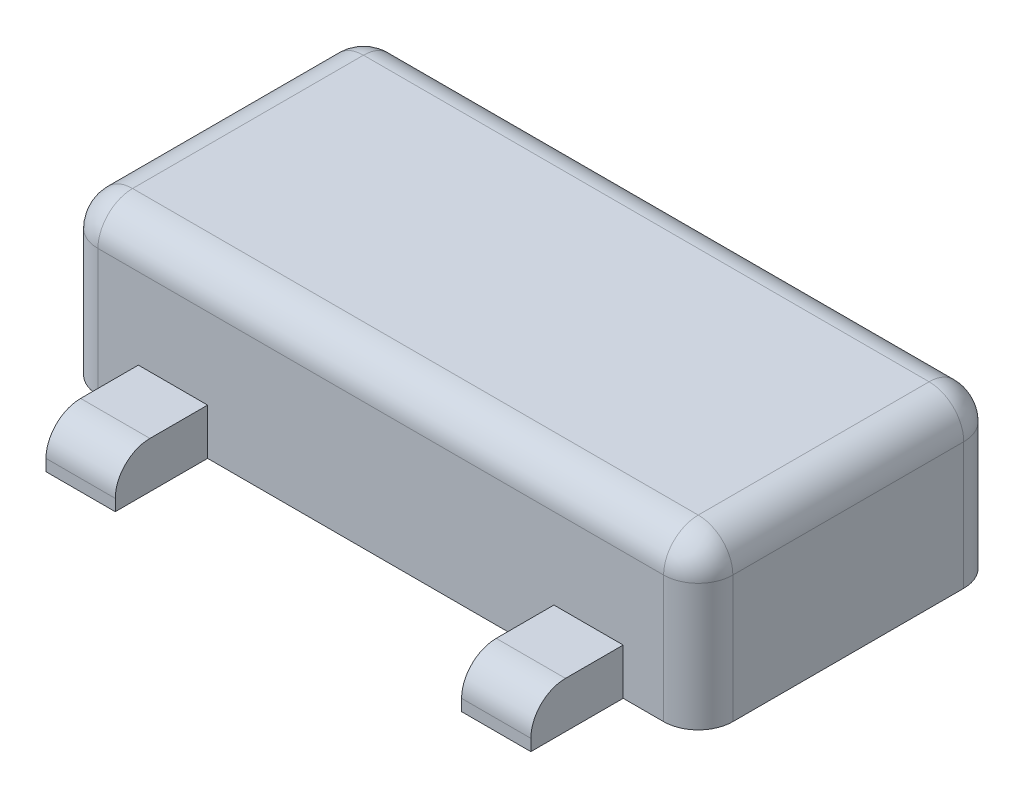
ISO-10303-21;
HEADER;
FILE_DESCRIPTION(('STEP AP214'),'2;1');
FILE_NAME('part.step','',(''),(''),'','','');
FILE_SCHEMA(('AUTOMOTIVE_DESIGN { 1 0 10303 214 1 1 1 1 }'));
ENDSEC;
DATA;
#1=APPLICATION_CONTEXT('core data for automotive mechanical design processes');
#2=APPLICATION_PROTOCOL_DEFINITION('international standard','automotive_design',2000,#1);
#3=PRODUCT_CONTEXT('',#1,'mechanical');
#4=PRODUCT('Part','Part','',(#3));
#5=PRODUCT_RELATED_PRODUCT_CATEGORY('part','',(#4));
#6=PRODUCT_DEFINITION_FORMATION('','',#4);
#7=PRODUCT_DEFINITION_CONTEXT('part definition',#1,'design');
#8=PRODUCT_DEFINITION('design','',#6,#7);
#9=PRODUCT_DEFINITION_SHAPE('','',#8);
#10=(LENGTH_UNIT() NAMED_UNIT(*) SI_UNIT(.MILLI.,.METRE.));
#11=(NAMED_UNIT(*) PLANE_ANGLE_UNIT() SI_UNIT($,.RADIAN.));
#12=(NAMED_UNIT(*) SI_UNIT($,.STERADIAN.) SOLID_ANGLE_UNIT());
#13=UNCERTAINTY_MEASURE_WITH_UNIT(LENGTH_MEASURE(1.E-05),#10,'distance_accuracy_value','');
#14=(GEOMETRIC_REPRESENTATION_CONTEXT(3) GLOBAL_UNCERTAINTY_ASSIGNED_CONTEXT((#13)) GLOBAL_UNIT_ASSIGNED_CONTEXT((#10,
#11,#12)) REPRESENTATION_CONTEXT('',''));
#15=CARTESIAN_POINT('',(0.,0.,0.));
#16=DIRECTION('',(0.,0.,1.));
#17=DIRECTION('',(1.,0.,0.));
#18=AXIS2_PLACEMENT_3D('',#15,#16,#17);
#19=CARTESIAN_POINT('',(-0.15,0.2,-0.65));
#20=DIRECTION('',(-1.,0.,0.));
#21=DIRECTION('',(0.,0.,1.));
#22=AXIS2_PLACEMENT_3D('',#19,#20,#21);
#23=PLANE('',#22);
#24=DIRECTION('',(0.,0.,-1.));
#25=VECTOR('',#24,1.);
#26=CARTESIAN_POINT('',(-0.15,0.2,-0.65));
#27=LINE('',#26,#25);
#28=CARTESIAN_POINT('',(-0.15,0.2,-0.65));
#29=VERTEX_POINT('',#28);
#30=CARTESIAN_POINT('',(-0.15,0.2,-0.9));
#31=VERTEX_POINT('',#30);
#32=EDGE_CURVE('P0_E68',#29,#31,#27,.T.);
#33=ORIENTED_EDGE('',*,*,#32,.T.);
#34=CARTESIAN_POINT('',(-0.15,0.05,-0.9));
#35=DIRECTION('',(-1.,0.,0.));
#36=DIRECTION('',(0.,0.,1.));
#37=AXIS2_PLACEMENT_3D('',#34,#35,#36);
#38=CIRCLE('',#37,0.15);
#39=CARTESIAN_POINT('',(-0.15,0.05,-1.05));
#40=VERTEX_POINT('',#39);
#41=EDGE_CURVE('P0_E11',#31,#40,#38,.T.);
#42=ORIENTED_EDGE('',*,*,#41,.T.);
#43=DIRECTION('',(0.,-1.,0.));
#44=VECTOR('',#43,1.);
#45=CARTESIAN_POINT('',(-0.15,0.2,-1.05));
#46=LINE('',#45,#44);
#47=CARTESIAN_POINT('',(-0.15,0.,-1.05));
#48=VERTEX_POINT('',#47);
#49=EDGE_CURVE('P0_E80',#40,#48,#46,.T.);
#50=ORIENTED_EDGE('',*,*,#49,.T.);
#51=DIRECTION('',(0.,0.,-1.));
#52=VECTOR('',#51,1.);
#53=CARTESIAN_POINT('',(-0.15,0.,-0.65));
#54=LINE('',#53,#52);
#55=CARTESIAN_POINT('',(-0.15,0.,-0.65));
#56=VERTEX_POINT('',#55);
#57=EDGE_CURVE('P0_E85',#56,#48,#54,.T.);
#58=ORIENTED_EDGE('',*,*,#57,.F.);
#59=DIRECTION('',(0.,-1.,0.));
#60=VECTOR('',#59,1.);
#61=CARTESIAN_POINT('',(-0.15,0.2,-0.65));
#62=LINE('',#61,#60);
#63=EDGE_CURVE('P0_E76',#29,#56,#62,.T.);
#64=ORIENTED_EDGE('',*,*,#63,.F.);
#65=EDGE_LOOP('',(#33,#42,#50,#58,#64));
#66=FACE_BOUND('',#65,.T.);
#67=ADVANCED_FACE('P0_F17',(#66),#23,.T.);
#68=CARTESIAN_POINT('',(-0.15,0.2,-0.65));
#69=DIRECTION('',(0.,0.,1.));
#70=DIRECTION('',(1.,0.,0.));
#71=AXIS2_PLACEMENT_3D('',#68,#69,#70);
#72=PLANE('',#71);
#73=DIRECTION('',(-1.,0.,0.));
#74=VECTOR('',#73,1.);
#75=CARTESIAN_POINT('',(-0.15,0.,-0.65));
#76=LINE('',#75,#74);
#77=CARTESIAN_POINT('',(0.15,0.,-0.65));
#78=VERTEX_POINT('',#77);
#79=EDGE_CURVE('P0_E75',#78,#56,#76,.T.);
#80=ORIENTED_EDGE('',*,*,#79,.F.);
#81=DIRECTION('',(0.,-1.,0.));
#82=VECTOR('',#81,1.);
#83=CARTESIAN_POINT('',(0.15,0.2,-0.65));
#84=LINE('',#83,#82);
#85=CARTESIAN_POINT('',(0.15,0.2,-0.65));
#86=VERTEX_POINT('',#85);
#87=EDGE_CURVE('P0_E64',#86,#78,#84,.T.);
#88=ORIENTED_EDGE('',*,*,#87,.F.);
#89=DIRECTION('',(-1.,0.,0.));
#90=VECTOR('',#89,1.);
#91=CARTESIAN_POINT('',(-0.15,0.2,-0.65));
#92=LINE('',#91,#90);
#93=EDGE_CURVE('P0_E67',#86,#29,#92,.T.);
#94=ORIENTED_EDGE('',*,*,#93,.T.);
#95=ORIENTED_EDGE('',*,*,#63,.T.);
#96=EDGE_LOOP('',(#80,#88,#94,#95));
#97=FACE_BOUND('',#96,.T.);
#98=ADVANCED_FACE('P0_F73',(#97),#72,.T.);
#99=CARTESIAN_POINT('',(0.15,0.2,-0.65));
#100=DIRECTION('',(1.,0.,0.));
#101=DIRECTION('',(0.,0.,-1.));
#102=AXIS2_PLACEMENT_3D('',#99,#100,#101);
#103=PLANE('',#102);
#104=DIRECTION('',(0.,-1.,0.));
#105=VECTOR('',#104,1.);
#106=CARTESIAN_POINT('',(0.15,0.2,-1.05));
#107=LINE('',#106,#105);
#108=CARTESIAN_POINT('',(0.15,0.05,-1.05));
#109=VERTEX_POINT('',#108);
#110=CARTESIAN_POINT('',(0.15,0.,-1.05));
#111=VERTEX_POINT('',#110);
#112=EDGE_CURVE('P0_E77',#109,#111,#107,.T.);
#113=ORIENTED_EDGE('',*,*,#112,.F.);
#114=CARTESIAN_POINT('',(0.15,0.05,-0.9));
#115=DIRECTION('',(1.,0.,0.));
#116=DIRECTION('',(0.,0.,-1.));
#117=AXIS2_PLACEMENT_3D('',#114,#115,#116);
#118=CIRCLE('',#117,0.15);
#119=CARTESIAN_POINT('',(0.15,0.2,-0.9));
#120=VERTEX_POINT('',#119);
#121=EDGE_CURVE('P0_E39',#109,#120,#118,.T.);
#122=ORIENTED_EDGE('',*,*,#121,.T.);
#123=DIRECTION('',(0.,0.,1.));
#124=VECTOR('',#123,1.);
#125=CARTESIAN_POINT('',(0.15,0.2,-0.65));
#126=LINE('',#125,#124);
#127=EDGE_CURVE('P0_E60',#120,#86,#126,.T.);
#128=ORIENTED_EDGE('',*,*,#127,.T.);
#129=ORIENTED_EDGE('',*,*,#87,.T.);
#130=DIRECTION('',(0.,0.,1.));
#131=VECTOR('',#130,1.);
#132=CARTESIAN_POINT('',(0.15,0.,-0.65));
#133=LINE('',#132,#131);
#134=EDGE_CURVE('P0_E91',#111,#78,#133,.T.);
#135=ORIENTED_EDGE('',*,*,#134,.F.);
#136=EDGE_LOOP('',(#113,#122,#128,#129,#135));
#137=FACE_BOUND('',#136,.T.);
#138=ADVANCED_FACE('P0_F62',(#137),#103,.T.);
#139=CARTESIAN_POINT('',(-0.15,0.2,-1.05));
#140=DIRECTION('',(0.,0.,-1.));
#141=DIRECTION('',(-1.,0.,0.));
#142=AXIS2_PLACEMENT_3D('',#139,#140,#141);
#143=PLANE('',#142);
#144=ORIENTED_EDGE('',*,*,#49,.F.);
#145=DIRECTION('',(1.,0.,0.));
#146=VECTOR('',#145,1.);
#147=CARTESIAN_POINT('',(0.15,0.05,-1.05));
#148=LINE('',#147,#146);
#149=EDGE_CURVE('P0_E94',#40,#109,#148,.T.);
#150=ORIENTED_EDGE('',*,*,#149,.T.);
#151=ORIENTED_EDGE('',*,*,#112,.T.);
#152=DIRECTION('',(1.,0.,0.));
#153=VECTOR('',#152,1.);
#154=CARTESIAN_POINT('',(-0.15,0.,-1.05));
#155=LINE('',#154,#153);
#156=EDGE_CURVE('P0_E88',#48,#111,#155,.T.);
#157=ORIENTED_EDGE('',*,*,#156,.F.);
#158=EDGE_LOOP('',(#144,#150,#151,#157));
#159=FACE_BOUND('',#158,.T.);
#160=ADVANCED_FACE('P0_F102',(#159),#143,.T.);
#161=CARTESIAN_POINT('',(0.,0.2,0.));
#162=DIRECTION('',(0.,-1.,0.));
#163=DIRECTION('',(0.,0.,-1.));
#164=AXIS2_PLACEMENT_3D('',#161,#162,#163);
#165=PLANE('',#164);
#166=ORIENTED_EDGE('',*,*,#127,.F.);
#167=DIRECTION('',(1.,0.,0.));
#168=VECTOR('',#167,1.);
#169=CARTESIAN_POINT('',(-0.15,0.2,-0.9));
#170=LINE('',#169,#168);
#171=EDGE_CURVE('P0_E25',#120,#31,#170,.F.);
#172=ORIENTED_EDGE('',*,*,#171,.T.);
#173=ORIENTED_EDGE('',*,*,#32,.F.);
#174=ORIENTED_EDGE('',*,*,#93,.F.);
#175=EDGE_LOOP('',(#166,#172,#173,#174));
#176=FACE_BOUND('',#175,.T.);
#177=ADVANCED_FACE('P0_F79',(#176),#165,.F.);
#178=CARTESIAN_POINT('',(0.,0.,0.));
#179=DIRECTION('',(0.,-1.,0.));
#180=DIRECTION('',(0.,0.,-1.));
#181=AXIS2_PLACEMENT_3D('',#178,#179,#180);
#182=PLANE('',#181);
#183=ORIENTED_EDGE('',*,*,#57,.T.);
#184=ORIENTED_EDGE('',*,*,#156,.T.);
#185=ORIENTED_EDGE('',*,*,#134,.T.);
#186=ORIENTED_EDGE('',*,*,#79,.T.);
#187=EDGE_LOOP('',(#183,#184,#185,#186));
#188=FACE_BOUND('',#187,.T.);
#189=ADVANCED_FACE('P0_F107',(#188),#182,.T.);
#190=CARTESIAN_POINT('',(-0.15,0.05,-0.9));
#191=DIRECTION('',(-1.,0.,0.));
#192=DIRECTION('',(0.,0.,1.));
#193=AXIS2_PLACEMENT_3D('',#190,#191,#192);
#194=CYLINDRICAL_SURFACE('',#193,0.15);
#195=ORIENTED_EDGE('',*,*,#41,.F.);
#196=ORIENTED_EDGE('',*,*,#171,.F.);
#197=ORIENTED_EDGE('',*,*,#121,.F.);
#198=ORIENTED_EDGE('',*,*,#149,.F.);
#199=EDGE_LOOP('',(#195,#196,#197,#198));
#200=FACE_BOUND('',#199,.T.);
#201=ADVANCED_FACE('P0_F19',(#200),#194,.T.);
#202=CLOSED_SHELL('',(#67,#98,#138,#160,#177,#189,#201));
#203=MANIFOLD_SOLID_BREP('P0_B1',#202);
#204=CARTESIAN_POINT('',(-1.05,0.2,0.65));
#205=DIRECTION('',(-1.,0.,0.));
#206=DIRECTION('',(0.,0.,1.));
#207=AXIS2_PLACEMENT_3D('',#204,#205,#206);
#208=PLANE('',#207);
#209=DIRECTION('',(0.,-1.,0.));
#210=VECTOR('',#209,1.);
#211=CARTESIAN_POINT('',(-1.05,0.2,1.05));
#212=LINE('',#211,#210);
#213=CARTESIAN_POINT('',(-1.05,0.05,1.05));
#214=VERTEX_POINT('',#213);
#215=CARTESIAN_POINT('',(-1.05,0.,1.05));
#216=VERTEX_POINT('',#215);
#217=EDGE_CURVE('P1_E90',#214,#216,#212,.T.);
#218=ORIENTED_EDGE('',*,*,#217,.F.);
#219=CARTESIAN_POINT('',(-1.05,0.05,0.9));
#220=DIRECTION('',(-1.,0.,0.));
#221=DIRECTION('',(0.,0.,1.));
#222=AXIS2_PLACEMENT_3D('',#219,#220,#221);
#223=CIRCLE('',#222,0.15);
#224=CARTESIAN_POINT('',(-1.05,0.2,0.9));
#225=VERTEX_POINT('',#224);
#226=EDGE_CURVE('P1_E39',#214,#225,#223,.T.);
#227=ORIENTED_EDGE('',*,*,#226,.T.);
#228=DIRECTION('',(0.,0.,-1.));
#229=VECTOR('',#228,1.);
#230=CARTESIAN_POINT('',(-1.05,0.2,0.65));
#231=LINE('',#230,#229);
#232=CARTESIAN_POINT('',(-1.05,0.2,0.65));
#233=VERTEX_POINT('',#232);
#234=EDGE_CURVE('P1_E60',#225,#233,#231,.T.);
#235=ORIENTED_EDGE('',*,*,#234,.T.);
#236=DIRECTION('',(0.,-1.,0.));
#237=VECTOR('',#236,1.);
#238=CARTESIAN_POINT('',(-1.05,0.2,0.65));
#239=LINE('',#238,#237);
#240=CARTESIAN_POINT('',(-1.05,0.,0.65));
#241=VERTEX_POINT('',#240);
#242=EDGE_CURVE('P1_E63',#233,#241,#239,.T.);
#243=ORIENTED_EDGE('',*,*,#242,.T.);
#244=DIRECTION('',(0.,0.,-1.));
#245=VECTOR('',#244,1.);
#246=CARTESIAN_POINT('',(-1.05,0.,0.65));
#247=LINE('',#246,#245);
#248=EDGE_CURVE('P1_E82',#216,#241,#247,.T.);
#249=ORIENTED_EDGE('',*,*,#248,.F.);
#250=EDGE_LOOP('',(#218,#227,#235,#243,#249));
#251=FACE_BOUND('',#250,.T.);
#252=ADVANCED_FACE('P1_F17',(#251),#208,.T.);
#253=CARTESIAN_POINT('',(-1.05,0.2,1.05));
#254=DIRECTION('',(0.,0.,1.));
#255=DIRECTION('',(1.,0.,0.));
#256=AXIS2_PLACEMENT_3D('',#253,#254,#255);
#257=PLANE('',#256);
#258=DIRECTION('',(0.,-1.,0.));
#259=VECTOR('',#258,1.);
#260=CARTESIAN_POINT('',(-0.75,0.2,1.05));
#261=LINE('',#260,#259);
#262=CARTESIAN_POINT('',(-0.75,0.05,1.05));
#263=VERTEX_POINT('',#262);
#264=CARTESIAN_POINT('',(-0.75,0.,1.05));
#265=VERTEX_POINT('',#264);
#266=EDGE_CURVE('P1_E93',#263,#265,#261,.T.);
#267=ORIENTED_EDGE('',*,*,#266,.F.);
#268=DIRECTION('',(-1.,0.,0.));
#269=VECTOR('',#268,1.);
#270=CARTESIAN_POINT('',(-1.05,0.05,1.05));
#271=LINE('',#270,#269);
#272=EDGE_CURVE('P1_E92',#263,#214,#271,.T.);
#273=ORIENTED_EDGE('',*,*,#272,.T.);
#274=ORIENTED_EDGE('',*,*,#217,.T.);
#275=DIRECTION('',(-1.,0.,0.));
#276=VECTOR('',#275,1.);
#277=CARTESIAN_POINT('',(-1.05,0.,1.05));
#278=LINE('',#277,#276);
#279=EDGE_CURVE('P1_E67',#265,#216,#278,.T.);
#280=ORIENTED_EDGE('',*,*,#279,.F.);
#281=EDGE_LOOP('',(#267,#273,#274,#280));
#282=FACE_BOUND('',#281,.T.);
#283=ADVANCED_FACE('P1_F101',(#282),#257,.T.);
#284=CARTESIAN_POINT('',(-0.75,0.2,0.65));
#285=DIRECTION('',(1.,0.,0.));
#286=DIRECTION('',(0.,0.,-1.));
#287=AXIS2_PLACEMENT_3D('',#284,#285,#286);
#288=PLANE('',#287);
#289=DIRECTION('',(0.,0.,1.));
#290=VECTOR('',#289,1.);
#291=CARTESIAN_POINT('',(-0.75,0.2,0.65));
#292=LINE('',#291,#290);
#293=CARTESIAN_POINT('',(-0.75,0.2,0.65));
#294=VERTEX_POINT('',#293);
#295=CARTESIAN_POINT('',(-0.75,0.2,0.9));
#296=VERTEX_POINT('',#295);
#297=EDGE_CURVE('P1_E76',#294,#296,#292,.T.);
#298=ORIENTED_EDGE('',*,*,#297,.T.);
#299=CARTESIAN_POINT('',(-0.75,0.05,0.9));
#300=DIRECTION('',(1.,0.,0.));
#301=DIRECTION('',(0.,0.,-1.));
#302=AXIS2_PLACEMENT_3D('',#299,#300,#301);
#303=CIRCLE('',#302,0.15);
#304=EDGE_CURVE('P1_E11',#296,#263,#303,.T.);
#305=ORIENTED_EDGE('',*,*,#304,.T.);
#306=ORIENTED_EDGE('',*,*,#266,.T.);
#307=DIRECTION('',(0.,0.,1.));
#308=VECTOR('',#307,1.);
#309=CARTESIAN_POINT('',(-0.75,0.,0.65));
#310=LINE('',#309,#308);
#311=CARTESIAN_POINT('',(-0.75,0.,0.65));
#312=VERTEX_POINT('',#311);
#313=EDGE_CURVE('P1_E85',#312,#265,#310,.T.);
#314=ORIENTED_EDGE('',*,*,#313,.F.);
#315=DIRECTION('',(0.,-1.,0.));
#316=VECTOR('',#315,1.);
#317=CARTESIAN_POINT('',(-0.75,0.2,0.65));
#318=LINE('',#317,#316);
#319=EDGE_CURVE('P1_E75',#294,#312,#318,.T.);
#320=ORIENTED_EDGE('',*,*,#319,.F.);
#321=EDGE_LOOP('',(#298,#305,#306,#314,#320));
#322=FACE_BOUND('',#321,.T.);
#323=ADVANCED_FACE('P1_F109',(#322),#288,.T.);
#324=CARTESIAN_POINT('',(-1.05,0.2,0.65));
#325=DIRECTION('',(0.,0.,-1.));
#326=DIRECTION('',(-1.,0.,0.));
#327=AXIS2_PLACEMENT_3D('',#324,#325,#326);
#328=PLANE('',#327);
#329=DIRECTION('',(1.,0.,0.));
#330=VECTOR('',#329,1.);
#331=CARTESIAN_POINT('',(-1.05,0.,0.65));
#332=LINE('',#331,#330);
#333=EDGE_CURVE('P1_E73',#241,#312,#332,.T.);
#334=ORIENTED_EDGE('',*,*,#333,.F.);
#335=ORIENTED_EDGE('',*,*,#242,.F.);
#336=DIRECTION('',(1.,0.,0.));
#337=VECTOR('',#336,1.);
#338=CARTESIAN_POINT('',(-1.05,0.2,0.65));
#339=LINE('',#338,#337);
#340=EDGE_CURVE('P1_E66',#233,#294,#339,.T.);
#341=ORIENTED_EDGE('',*,*,#340,.T.);
#342=ORIENTED_EDGE('',*,*,#319,.T.);
#343=EDGE_LOOP('',(#334,#335,#341,#342));
#344=FACE_BOUND('',#343,.T.);
#345=ADVANCED_FACE('P1_F71',(#344),#328,.T.);
#346=CARTESIAN_POINT('',(0.,0.2,0.));
#347=DIRECTION('',(0.,1.,0.));
#348=DIRECTION('',(0.,0.,1.));
#349=AXIS2_PLACEMENT_3D('',#346,#347,#348);
#350=PLANE('',#349);
#351=ORIENTED_EDGE('',*,*,#234,.F.);
#352=DIRECTION('',(-1.,0.,0.));
#353=VECTOR('',#352,1.);
#354=CARTESIAN_POINT('',(0.,0.2,0.9));
#355=LINE('',#354,#353);
#356=EDGE_CURVE('P1_E25',#225,#296,#355,.F.);
#357=ORIENTED_EDGE('',*,*,#356,.T.);
#358=ORIENTED_EDGE('',*,*,#297,.F.);
#359=ORIENTED_EDGE('',*,*,#340,.F.);
#360=EDGE_LOOP('',(#351,#357,#358,#359));
#361=FACE_BOUND('',#360,.T.);
#362=ADVANCED_FACE('P1_F78',(#361),#350,.T.);
#363=CARTESIAN_POINT('',(0.,0.,0.));
#364=DIRECTION('',(0.,1.,0.));
#365=DIRECTION('',(0.,0.,1.));
#366=AXIS2_PLACEMENT_3D('',#363,#364,#365);
#367=PLANE('',#366);
#368=ORIENTED_EDGE('',*,*,#248,.T.);
#369=ORIENTED_EDGE('',*,*,#333,.T.);
#370=ORIENTED_EDGE('',*,*,#313,.T.);
#371=ORIENTED_EDGE('',*,*,#279,.T.);
#372=EDGE_LOOP('',(#368,#369,#370,#371));
#373=FACE_BOUND('',#372,.T.);
#374=ADVANCED_FACE('P1_F106',(#373),#367,.F.);
#375=CARTESIAN_POINT('',(-1.05,0.05,0.9));
#376=DIRECTION('',(-1.,0.,0.));
#377=DIRECTION('',(0.,0.,1.));
#378=AXIS2_PLACEMENT_3D('',#375,#376,#377);
#379=CYLINDRICAL_SURFACE('',#378,0.15);
#380=ORIENTED_EDGE('',*,*,#304,.F.);
#381=ORIENTED_EDGE('',*,*,#356,.F.);
#382=ORIENTED_EDGE('',*,*,#226,.F.);
#383=ORIENTED_EDGE('',*,*,#272,.F.);
#384=EDGE_LOOP('',(#380,#381,#382,#383));
#385=FACE_BOUND('',#384,.T.);
#386=ADVANCED_FACE('P1_F19',(#385),#379,.T.);
#387=CLOSED_SHELL('',(#252,#283,#323,#345,#362,#374,#386));
#388=MANIFOLD_SOLID_BREP('P1_B1',#387);
#389=CARTESIAN_POINT('',(1.375,0.7,0.65));
#390=DIRECTION('',(-1.,0.,0.));
#391=DIRECTION('',(0.,0.,1.));
#392=AXIS2_PLACEMENT_3D('',#389,#390,#391);
#393=PLANE('',#392);
#394=DIRECTION('',(0.,0.,-1.));
#395=VECTOR('',#394,1.);
#396=CARTESIAN_POINT('',(1.375,0.,0.65));
#397=LINE('',#396,#395);
#398=CARTESIAN_POINT('',(1.375,0.,0.5));
#399=VERTEX_POINT('',#398);
#400=CARTESIAN_POINT('',(1.375,0.,-0.5));
#401=VERTEX_POINT('',#400);
#402=EDGE_CURVE('P2_E182',#399,#401,#397,.T.);
#403=ORIENTED_EDGE('',*,*,#402,.T.);
#404=DIRECTION('',(0.,-1.,0.));
#405=VECTOR('',#404,1.);
#406=CARTESIAN_POINT('',(1.375,0.7,-0.5));
#407=LINE('',#406,#405);
#408=CARTESIAN_POINT('',(1.375,0.55,-0.5));
#409=VERTEX_POINT('',#408);
#410=EDGE_CURVE('P2_E34',#401,#409,#407,.F.);
#411=ORIENTED_EDGE('',*,*,#410,.T.);
#412=DIRECTION('',(0.,0.,-1.));
#413=VECTOR('',#412,1.);
#414=CARTESIAN_POINT('',(1.375,0.55,0.65));
#415=LINE('',#414,#413);
#416=CARTESIAN_POINT('',(1.375,0.55,0.5));
#417=VERTEX_POINT('',#416);
#418=EDGE_CURVE('P2_E39',#409,#417,#415,.F.);
#419=ORIENTED_EDGE('',*,*,#418,.T.);
#420=DIRECTION('',(0.,-1.,0.));
#421=VECTOR('',#420,1.);
#422=CARTESIAN_POINT('',(1.375,0.7,0.5));
#423=LINE('',#422,#421);
#424=EDGE_CURVE('P2_E151',#417,#399,#423,.T.);
#425=ORIENTED_EDGE('',*,*,#424,.T.);
#426=EDGE_LOOP('',(#403,#411,#419,#425));
#427=FACE_BOUND('',#426,.T.);
#428=ADVANCED_FACE('P2_F17',(#427),#393,.F.);
#429=CARTESIAN_POINT('',(-1.375,0.7,-0.65));
#430=DIRECTION('',(0.,0.,1.));
#431=DIRECTION('',(1.,0.,0.));
#432=AXIS2_PLACEMENT_3D('',#429,#430,#431);
#433=PLANE('',#432);
#434=DIRECTION('',(-1.,0.,0.));
#435=VECTOR('',#434,1.);
#436=CARTESIAN_POINT('',(-1.375,0.55,-0.65));
#437=LINE('',#436,#435);
#438=CARTESIAN_POINT('',(-1.225,0.55,-0.65));
#439=VERTEX_POINT('',#438);
#440=CARTESIAN_POINT('',(1.225,0.55,-0.65));
#441=VERTEX_POINT('',#440);
#442=EDGE_CURVE('P2_E147',#439,#441,#437,.F.);
#443=ORIENTED_EDGE('',*,*,#442,.T.);
#444=DIRECTION('',(0.,-1.,0.));
#445=VECTOR('',#444,1.);
#446=CARTESIAN_POINT('',(1.225,0.7,-0.65));
#447=LINE('',#446,#445);
#448=CARTESIAN_POINT('',(1.225,0.,-0.65));
#449=VERTEX_POINT('',#448);
#450=EDGE_CURVE('P2_E149',#441,#449,#447,.T.);
#451=ORIENTED_EDGE('',*,*,#450,.T.);
#452=DIRECTION('',(-1.,0.,0.));
#453=VECTOR('',#452,1.);
#454=CARTESIAN_POINT('',(-1.375,0.,-0.65));
#455=LINE('',#454,#453);
#456=CARTESIAN_POINT('',(-1.225,0.,-0.65));
#457=VERTEX_POINT('',#456);
#458=EDGE_CURVE('P2_E184',#449,#457,#455,.T.);
#459=ORIENTED_EDGE('',*,*,#458,.T.);
#460=DIRECTION('',(0.,-1.,0.));
#461=VECTOR('',#460,1.);
#462=CARTESIAN_POINT('',(-1.225,0.7,-0.65));
#463=LINE('',#462,#461);
#464=EDGE_CURVE('P2_E145',#457,#439,#463,.F.);
#465=ORIENTED_EDGE('',*,*,#464,.T.);
#466=EDGE_LOOP('',(#443,#451,#459,#465));
#467=FACE_BOUND('',#466,.T.);
#468=ADVANCED_FACE('P2_F237',(#467),#433,.F.);
#469=CARTESIAN_POINT('',(-1.375,0.7,0.65));
#470=DIRECTION('',(1.,0.,0.));
#471=DIRECTION('',(0.,0.,-1.));
#472=AXIS2_PLACEMENT_3D('',#469,#470,#471);
#473=PLANE('',#472);
#474=DIRECTION('',(0.,0.,1.));
#475=VECTOR('',#474,1.);
#476=CARTESIAN_POINT('',(-1.375,0.55,0.65));
#477=LINE('',#476,#475);
#478=CARTESIAN_POINT('',(-1.375,0.55,0.5));
#479=VERTEX_POINT('',#478);
#480=CARTESIAN_POINT('',(-1.375,0.55,-0.5));
#481=VERTEX_POINT('',#480);
#482=EDGE_CURVE('P2_E141',#479,#481,#477,.F.);
#483=ORIENTED_EDGE('',*,*,#482,.T.);
#484=DIRECTION('',(0.,-1.,0.));
#485=VECTOR('',#484,1.);
#486=CARTESIAN_POINT('',(-1.375,0.7,-0.5));
#487=LINE('',#486,#485);
#488=CARTESIAN_POINT('',(-1.375,0.,-0.5));
#489=VERTEX_POINT('',#488);
#490=EDGE_CURVE('P2_E143',#481,#489,#487,.T.);
#491=ORIENTED_EDGE('',*,*,#490,.T.);
#492=DIRECTION('',(0.,0.,1.));
#493=VECTOR('',#492,1.);
#494=CARTESIAN_POINT('',(-1.375,0.,0.65));
#495=LINE('',#494,#493);
#496=CARTESIAN_POINT('',(-1.375,0.,0.5));
#497=VERTEX_POINT('',#496);
#498=EDGE_CURVE('P2_E188',#489,#497,#495,.T.);
#499=ORIENTED_EDGE('',*,*,#498,.T.);
#500=DIRECTION('',(0.,-1.,0.));
#501=VECTOR('',#500,1.);
#502=CARTESIAN_POINT('',(-1.375,0.7,0.5));
#503=LINE('',#502,#501);
#504=EDGE_CURVE('P2_E139',#497,#479,#503,.F.);
#505=ORIENTED_EDGE('',*,*,#504,.T.);
#506=EDGE_LOOP('',(#483,#491,#499,#505));
#507=FACE_BOUND('',#506,.T.);
#508=ADVANCED_FACE('P2_F242',(#507),#473,.F.);
#509=CARTESIAN_POINT('',(-1.375,0.7,0.65));
#510=DIRECTION('',(0.,0.,-1.));
#511=DIRECTION('',(-1.,0.,0.));
#512=AXIS2_PLACEMENT_3D('',#509,#510,#511);
#513=PLANE('',#512);
#514=DIRECTION('',(1.,0.,0.));
#515=VECTOR('',#514,1.);
#516=CARTESIAN_POINT('',(-1.375,0.,0.65));
#517=LINE('',#516,#515);
#518=CARTESIAN_POINT('',(-1.225,0.,0.65));
#519=VERTEX_POINT('',#518);
#520=CARTESIAN_POINT('',(1.225,0.,0.65));
#521=VERTEX_POINT('',#520);
#522=EDGE_CURVE('P2_E124',#519,#521,#517,.T.);
#523=ORIENTED_EDGE('',*,*,#522,.T.);
#524=DIRECTION('',(0.,-1.,0.));
#525=VECTOR('',#524,1.);
#526=CARTESIAN_POINT('',(1.225,0.7,0.65));
#527=LINE('',#526,#525);
#528=CARTESIAN_POINT('',(1.225,0.55,0.65));
#529=VERTEX_POINT('',#528);
#530=EDGE_CURVE('P2_E137',#521,#529,#527,.F.);
#531=ORIENTED_EDGE('',*,*,#530,.T.);
#532=DIRECTION('',(1.,0.,0.));
#533=VECTOR('',#532,1.);
#534=CARTESIAN_POINT('',(-1.375,0.55,0.65));
#535=LINE('',#534,#533);
#536=CARTESIAN_POINT('',(-1.225,0.55,0.65));
#537=VERTEX_POINT('',#536);
#538=EDGE_CURVE('P2_E102',#529,#537,#535,.F.);
#539=ORIENTED_EDGE('',*,*,#538,.T.);
#540=DIRECTION('',(0.,-1.,0.));
#541=VECTOR('',#540,1.);
#542=CARTESIAN_POINT('',(-1.225,0.7,0.65));
#543=LINE('',#542,#541);
#544=EDGE_CURVE('P2_E130',#537,#519,#543,.T.);
#545=ORIENTED_EDGE('',*,*,#544,.T.);
#546=EDGE_LOOP('',(#523,#531,#539,#545));
#547=FACE_BOUND('',#546,.T.);
#548=ADVANCED_FACE('P2_F213',(#547),#513,.F.);
#549=CARTESIAN_POINT('',(0.,0.7,0.));
#550=DIRECTION('',(0.,-1.,0.));
#551=DIRECTION('',(0.,0.,-1.));
#552=AXIS2_PLACEMENT_3D('',#549,#550,#551);
#553=PLANE('',#552);
#554=DIRECTION('',(0.,0.,1.));
#555=VECTOR('',#554,1.);
#556=CARTESIAN_POINT('',(-1.225,0.7,0.));
#557=LINE('',#556,#555);
#558=CARTESIAN_POINT('',(-1.225,0.7,-0.5));
#559=VERTEX_POINT('',#558);
#560=CARTESIAN_POINT('',(-1.225,0.7,0.5));
#561=VERTEX_POINT('',#560);
#562=EDGE_CURVE('P2_E128',#559,#561,#557,.T.);
#563=ORIENTED_EDGE('',*,*,#562,.T.);
#564=DIRECTION('',(1.,0.,0.));
#565=VECTOR('',#564,1.);
#566=CARTESIAN_POINT('',(0.,0.7,0.5));
#567=LINE('',#566,#565);
#568=CARTESIAN_POINT('',(1.225,0.7,0.5));
#569=VERTEX_POINT('',#568);
#570=EDGE_CURVE('P2_E100',#561,#569,#567,.T.);
#571=ORIENTED_EDGE('',*,*,#570,.T.);
#572=DIRECTION('',(0.,0.,-1.));
#573=VECTOR('',#572,1.);
#574=CARTESIAN_POINT('',(1.225,0.7,0.));
#575=LINE('',#574,#573);
#576=CARTESIAN_POINT('',(1.225,0.7,-0.5));
#577=VERTEX_POINT('',#576);
#578=EDGE_CURVE('P2_E117',#569,#577,#575,.T.);
#579=ORIENTED_EDGE('',*,*,#578,.T.);
#580=DIRECTION('',(-1.,0.,0.));
#581=VECTOR('',#580,1.);
#582=CARTESIAN_POINT('',(0.,0.7,-0.5));
#583=LINE('',#582,#581);
#584=EDGE_CURVE('P2_E123',#577,#559,#583,.T.);
#585=ORIENTED_EDGE('',*,*,#584,.T.);
#586=EDGE_LOOP('',(#563,#571,#579,#585));
#587=FACE_BOUND('',#586,.T.);
#588=ADVANCED_FACE('P2_F126',(#587),#553,.F.);
#589=CARTESIAN_POINT('',(0.,0.,0.));
#590=DIRECTION('',(0.,-1.,0.));
#591=DIRECTION('',(0.,0.,-1.));
#592=AXIS2_PLACEMENT_3D('',#589,#590,#591);
#593=PLANE('',#592);
#594=ORIENTED_EDGE('',*,*,#458,.F.);
#595=CARTESIAN_POINT('',(1.225,0.,-0.5));
#596=DIRECTION('',(0.,-1.,0.));
#597=DIRECTION('',(0.,0.,-1.));
#598=AXIS2_PLACEMENT_3D('',#595,#596,#597);
#599=CIRCLE('',#598,0.15);
#600=EDGE_CURVE('P2_E11',#449,#401,#599,.T.);
#601=ORIENTED_EDGE('',*,*,#600,.T.);
#602=ORIENTED_EDGE('',*,*,#402,.F.);
#603=CARTESIAN_POINT('',(1.225,0.,0.5));
#604=DIRECTION('',(0.,-1.,0.));
#605=DIRECTION('',(0.,0.,-1.));
#606=AXIS2_PLACEMENT_3D('',#603,#604,#605);
#607=CIRCLE('',#606,0.15);
#608=EDGE_CURVE('P2_E26',#399,#521,#607,.T.);
#609=ORIENTED_EDGE('',*,*,#608,.T.);
#610=ORIENTED_EDGE('',*,*,#522,.F.);
#611=CARTESIAN_POINT('',(-1.225,0.,0.5));
#612=DIRECTION('',(0.,-1.,0.));
#613=DIRECTION('',(0.,0.,-1.));
#614=AXIS2_PLACEMENT_3D('',#611,#612,#613);
#615=CIRCLE('',#614,0.15);
#616=EDGE_CURVE('P2_E155',#519,#497,#615,.T.);
#617=ORIENTED_EDGE('',*,*,#616,.T.);
#618=ORIENTED_EDGE('',*,*,#498,.F.);
#619=CARTESIAN_POINT('',(-1.225,0.,-0.5));
#620=DIRECTION('',(0.,-1.,0.));
#621=DIRECTION('',(0.,0.,-1.));
#622=AXIS2_PLACEMENT_3D('',#619,#620,#621);
#623=CIRCLE('',#622,0.15);
#624=EDGE_CURVE('P2_E157',#489,#457,#623,.T.);
#625=ORIENTED_EDGE('',*,*,#624,.T.);
#626=EDGE_LOOP('',(#594,#601,#602,#609,#610,#617,#618,#625));
#627=FACE_BOUND('',#626,.T.);
#628=ADVANCED_FACE('P2_F220',(#627),#593,.T.);
#629=CARTESIAN_POINT('',(-1.225,0.7,-0.5));
#630=DIRECTION('',(0.,-1.,0.));
#631=DIRECTION('',(0.,0.,-1.));
#632=AXIS2_PLACEMENT_3D('',#629,#630,#631);
#633=CYLINDRICAL_SURFACE('',#632,0.15);
#634=ORIENTED_EDGE('',*,*,#624,.F.);
#635=ORIENTED_EDGE('',*,*,#490,.F.);
#636=CARTESIAN_POINT('',(-1.225,0.55,-0.5));
#637=DIRECTION('',(0.,1.,0.));
#638=DIRECTION('',(0.,0.,1.));
#639=AXIS2_PLACEMENT_3D('',#636,#637,#638);
#640=CIRCLE('',#639,0.15);
#641=EDGE_CURVE('P2_E21',#439,#481,#640,.T.);
#642=ORIENTED_EDGE('',*,*,#641,.F.);
#643=ORIENTED_EDGE('',*,*,#464,.F.);
#644=EDGE_LOOP('',(#634,#635,#642,#643));
#645=FACE_BOUND('',#644,.T.);
#646=ADVANCED_FACE('P2_F19',(#645),#633,.T.);
#647=CARTESIAN_POINT('',(0.,0.55,-0.5));
#648=DIRECTION('',(-1.,0.,0.));
#649=DIRECTION('',(0.,0.,1.));
#650=AXIS2_PLACEMENT_3D('',#647,#648,#649);
#651=CYLINDRICAL_SURFACE('',#650,0.15);
#652=CARTESIAN_POINT('',(1.225,0.55,-0.5));
#653=DIRECTION('',(1.,0.,0.));
#654=DIRECTION('',(0.,0.,-1.));
#655=AXIS2_PLACEMENT_3D('',#652,#653,#654);
#656=CIRCLE('',#655,0.15);
#657=EDGE_CURVE('P2_E174',#441,#577,#656,.T.);
#658=ORIENTED_EDGE('',*,*,#657,.F.);
#659=ORIENTED_EDGE('',*,*,#442,.F.);
#660=CARTESIAN_POINT('',(-1.225,0.55,-0.5));
#661=DIRECTION('',(-1.,0.,0.));
#662=DIRECTION('',(0.,0.,1.));
#663=AXIS2_PLACEMENT_3D('',#660,#661,#662);
#664=CIRCLE('',#663,0.15);
#665=EDGE_CURVE('P2_E176',#559,#439,#664,.T.);
#666=ORIENTED_EDGE('',*,*,#665,.F.);
#667=ORIENTED_EDGE('',*,*,#584,.F.);
#668=EDGE_LOOP('',(#658,#659,#666,#667));
#669=FACE_BOUND('',#668,.T.);
#670=ADVANCED_FACE('P2_F197',(#669),#651,.T.);
#671=CARTESIAN_POINT('',(1.225,0.7,-0.5));
#672=DIRECTION('',(0.,-1.,0.));
#673=DIRECTION('',(0.,0.,-1.));
#674=AXIS2_PLACEMENT_3D('',#671,#672,#673);
#675=CYLINDRICAL_SURFACE('',#674,0.15);
#676=ORIENTED_EDGE('',*,*,#600,.F.);
#677=ORIENTED_EDGE('',*,*,#450,.F.);
#678=CARTESIAN_POINT('',(1.225,0.55,-0.5));
#679=DIRECTION('',(0.,1.,0.));
#680=DIRECTION('',(0.,0.,1.));
#681=AXIS2_PLACEMENT_3D('',#678,#679,#680);
#682=CIRCLE('',#681,0.15);
#683=EDGE_CURVE('P2_E171',#409,#441,#682,.T.);
#684=ORIENTED_EDGE('',*,*,#683,.F.);
#685=ORIENTED_EDGE('',*,*,#410,.F.);
#686=EDGE_LOOP('',(#676,#677,#684,#685));
#687=FACE_BOUND('',#686,.T.);
#688=ADVANCED_FACE('P2_F224',(#687),#675,.T.);
#689=CARTESIAN_POINT('',(-1.225,0.55,-0.5));
#690=DIRECTION('',(0.,0.,1.));
#691=DIRECTION('',(1.,0.,0.));
#692=AXIS2_PLACEMENT_3D('',#689,#690,#691);
#693=SPHERICAL_SURFACE('',#692,0.15);
#694=ORIENTED_EDGE('',*,*,#665,.T.);
#695=ORIENTED_EDGE('',*,*,#641,.T.);
#696=CARTESIAN_POINT('',(-1.225,0.55,-0.5));
#697=DIRECTION('',(0.,0.,-1.));
#698=DIRECTION('',(-1.,0.,0.));
#699=AXIS2_PLACEMENT_3D('',#696,#697,#698);
#700=CIRCLE('',#699,0.15);
#701=EDGE_CURVE('P2_E168',#559,#481,#700,.F.);
#702=ORIENTED_EDGE('',*,*,#701,.F.);
#703=EDGE_LOOP('',(#694,#695,#702));
#704=FACE_BOUND('',#703,.T.);
#705=ADVANCED_FACE('P2_F198',(#704),#693,.T.);
#706=CARTESIAN_POINT('',(1.225,0.55,-0.5));
#707=DIRECTION('',(0.,0.,1.));
#708=DIRECTION('',(1.,0.,0.));
#709=AXIS2_PLACEMENT_3D('',#706,#707,#708);
#710=SPHERICAL_SURFACE('',#709,0.15);
#711=ORIENTED_EDGE('',*,*,#683,.T.);
#712=ORIENTED_EDGE('',*,*,#657,.T.);
#713=CARTESIAN_POINT('',(1.225,0.55,-0.5));
#714=DIRECTION('',(0.,0.,-1.));
#715=DIRECTION('',(-1.,0.,0.));
#716=AXIS2_PLACEMENT_3D('',#713,#714,#715);
#717=CIRCLE('',#716,0.15);
#718=EDGE_CURVE('P2_E120',#409,#577,#717,.F.);
#719=ORIENTED_EDGE('',*,*,#718,.F.);
#720=EDGE_LOOP('',(#711,#712,#719));
#721=FACE_BOUND('',#720,.T.);
#722=ADVANCED_FACE('P2_F226',(#721),#710,.T.);
#723=CARTESIAN_POINT('',(-1.225,0.7,0.5));
#724=DIRECTION('',(0.,-1.,0.));
#725=DIRECTION('',(0.,0.,-1.));
#726=AXIS2_PLACEMENT_3D('',#723,#724,#725);
#727=CYLINDRICAL_SURFACE('',#726,0.15);
#728=ORIENTED_EDGE('',*,*,#616,.F.);
#729=ORIENTED_EDGE('',*,*,#544,.F.);
#730=CARTESIAN_POINT('',(-1.225,0.55,0.5));
#731=DIRECTION('',(0.,1.,0.));
#732=DIRECTION('',(0.,0.,1.));
#733=AXIS2_PLACEMENT_3D('',#730,#731,#732);
#734=CIRCLE('',#733,0.15);
#735=EDGE_CURVE('P2_E164',#479,#537,#734,.T.);
#736=ORIENTED_EDGE('',*,*,#735,.F.);
#737=ORIENTED_EDGE('',*,*,#504,.F.);
#738=EDGE_LOOP('',(#728,#729,#736,#737));
#739=FACE_BOUND('',#738,.T.);
#740=ADVANCED_FACE('P2_F210',(#739),#727,.T.);
#741=CARTESIAN_POINT('',(-1.225,0.55,0.));
#742=DIRECTION('',(0.,0.,1.));
#743=DIRECTION('',(1.,0.,0.));
#744=AXIS2_PLACEMENT_3D('',#741,#742,#743);
#745=CYLINDRICAL_SURFACE('',#744,0.15);
#746=ORIENTED_EDGE('',*,*,#701,.T.);
#747=ORIENTED_EDGE('',*,*,#482,.F.);
#748=CARTESIAN_POINT('',(-1.225,0.55,0.5));
#749=DIRECTION('',(0.,0.,1.));
#750=DIRECTION('',(1.,0.,0.));
#751=AXIS2_PLACEMENT_3D('',#748,#749,#750);
#752=CIRCLE('',#751,0.15);
#753=EDGE_CURVE('P2_E114',#561,#479,#752,.T.);
#754=ORIENTED_EDGE('',*,*,#753,.F.);
#755=ORIENTED_EDGE('',*,*,#562,.F.);
#756=EDGE_LOOP('',(#746,#747,#754,#755));
#757=FACE_BOUND('',#756,.T.);
#758=ADVANCED_FACE('P2_F201',(#757),#745,.T.);
#759=CARTESIAN_POINT('',(1.225,0.55,0.));
#760=DIRECTION('',(0.,0.,-1.));
#761=DIRECTION('',(-1.,0.,0.));
#762=AXIS2_PLACEMENT_3D('',#759,#760,#761);
#763=CYLINDRICAL_SURFACE('',#762,0.15);
#764=ORIENTED_EDGE('',*,*,#718,.T.);
#765=ORIENTED_EDGE('',*,*,#578,.F.);
#766=CARTESIAN_POINT('',(1.225,0.55,0.5));
#767=DIRECTION('',(0.,0.,1.));
#768=DIRECTION('',(1.,0.,0.));
#769=AXIS2_PLACEMENT_3D('',#766,#767,#768);
#770=CIRCLE('',#769,0.15);
#771=EDGE_CURVE('P2_E108',#417,#569,#770,.T.);
#772=ORIENTED_EDGE('',*,*,#771,.F.);
#773=ORIENTED_EDGE('',*,*,#418,.F.);
#774=EDGE_LOOP('',(#764,#765,#772,#773));
#775=FACE_BOUND('',#774,.T.);
#776=ADVANCED_FACE('P2_F118',(#775),#763,.T.);
#777=CARTESIAN_POINT('',(1.225,0.7,0.5));
#778=DIRECTION('',(0.,-1.,0.));
#779=DIRECTION('',(0.,0.,-1.));
#780=AXIS2_PLACEMENT_3D('',#777,#778,#779);
#781=CYLINDRICAL_SURFACE('',#780,0.15);
#782=ORIENTED_EDGE('',*,*,#608,.F.);
#783=ORIENTED_EDGE('',*,*,#424,.F.);
#784=CARTESIAN_POINT('',(1.225,0.55,0.5));
#785=DIRECTION('',(0.,1.,0.));
#786=DIRECTION('',(0.,0.,1.));
#787=AXIS2_PLACEMENT_3D('',#784,#785,#786);
#788=CIRCLE('',#787,0.15);
#789=EDGE_CURVE('P2_E112',#529,#417,#788,.T.);
#790=ORIENTED_EDGE('',*,*,#789,.F.);
#791=ORIENTED_EDGE('',*,*,#530,.F.);
#792=EDGE_LOOP('',(#782,#783,#790,#791));
#793=FACE_BOUND('',#792,.T.);
#794=ADVANCED_FACE('P2_F217',(#793),#781,.T.);
#795=CARTESIAN_POINT('',(-1.225,0.55,0.5));
#796=DIRECTION('',(0.,0.,1.));
#797=DIRECTION('',(1.,0.,0.));
#798=AXIS2_PLACEMENT_3D('',#795,#796,#797);
#799=SPHERICAL_SURFACE('',#798,0.15);
#800=ORIENTED_EDGE('',*,*,#753,.T.);
#801=ORIENTED_EDGE('',*,*,#735,.T.);
#802=CARTESIAN_POINT('',(-1.225,0.55,0.5));
#803=DIRECTION('',(-1.,0.,0.));
#804=DIRECTION('',(0.,0.,1.));
#805=AXIS2_PLACEMENT_3D('',#802,#803,#804);
#806=CIRCLE('',#805,0.15);
#807=EDGE_CURVE('P2_E105',#561,#537,#806,.F.);
#808=ORIENTED_EDGE('',*,*,#807,.F.);
#809=EDGE_LOOP('',(#800,#801,#808));
#810=FACE_BOUND('',#809,.T.);
#811=ADVANCED_FACE('P2_F205',(#810),#799,.T.);
#812=CARTESIAN_POINT('',(1.225,0.55,0.5));
#813=DIRECTION('',(0.,0.,1.));
#814=DIRECTION('',(1.,0.,0.));
#815=AXIS2_PLACEMENT_3D('',#812,#813,#814);
#816=SPHERICAL_SURFACE('',#815,0.15);
#817=ORIENTED_EDGE('',*,*,#789,.T.);
#818=ORIENTED_EDGE('',*,*,#771,.T.);
#819=CARTESIAN_POINT('',(1.225,0.55,0.5));
#820=DIRECTION('',(1.,0.,0.));
#821=DIRECTION('',(0.,0.,-1.));
#822=AXIS2_PLACEMENT_3D('',#819,#820,#821);
#823=CIRCLE('',#822,0.15);
#824=EDGE_CURVE('P2_E96',#529,#569,#823,.F.);
#825=ORIENTED_EDGE('',*,*,#824,.F.);
#826=EDGE_LOOP('',(#817,#818,#825));
#827=FACE_BOUND('',#826,.T.);
#828=ADVANCED_FACE('P2_F110',(#827),#816,.T.);
#829=CARTESIAN_POINT('',(0.,0.55,0.5));
#830=DIRECTION('',(1.,0.,0.));
#831=DIRECTION('',(0.,0.,-1.));
#832=AXIS2_PLACEMENT_3D('',#829,#830,#831);
#833=CYLINDRICAL_SURFACE('',#832,0.15);
#834=ORIENTED_EDGE('',*,*,#807,.T.);
#835=ORIENTED_EDGE('',*,*,#538,.F.);
#836=ORIENTED_EDGE('',*,*,#824,.T.);
#837=ORIENTED_EDGE('',*,*,#570,.F.);
#838=EDGE_LOOP('',(#834,#835,#836,#837));
#839=FACE_BOUND('',#838,.T.);
#840=ADVANCED_FACE('P2_F98',(#839),#833,.T.);
#841=CLOSED_SHELL('',(#428,#468,#508,#548,#588,#628,#646,#670,#688,#705,#722,#740,#758,#776,
#794,#811,#828,#840));
#842=MANIFOLD_SOLID_BREP('P2_B1',#841);
#843=CARTESIAN_POINT('',(1.05,0.2,0.65));
#844=DIRECTION('',(0.,0.,-1.));
#845=DIRECTION('',(-1.,0.,0.));
#846=AXIS2_PLACEMENT_3D('',#843,#844,#845);
#847=PLANE('',#846);
#848=DIRECTION('',(1.,0.,0.));
#849=VECTOR('',#848,1.);
#850=CARTESIAN_POINT('',(1.05,0.,0.65));
#851=LINE('',#850,#849);
#852=CARTESIAN_POINT('',(0.75,0.,0.65));
#853=VERTEX_POINT('',#852);
#854=CARTESIAN_POINT('',(1.05,0.,0.65));
#855=VERTEX_POINT('',#854);
#856=EDGE_CURVE('P3_E88',#853,#855,#851,.T.);
#857=ORIENTED_EDGE('',*,*,#856,.F.);
#858=DIRECTION('',(0.,-1.,0.));
#859=VECTOR('',#858,1.);
#860=CARTESIAN_POINT('',(0.75,0.2,0.65));
#861=LINE('',#860,#859);
#862=CARTESIAN_POINT('',(0.75,0.2,0.65));
#863=VERTEX_POINT('',#862);
#864=EDGE_CURVE('P3_E80',#863,#853,#861,.T.);
#865=ORIENTED_EDGE('',*,*,#864,.F.);
#866=DIRECTION('',(1.,0.,0.));
#867=VECTOR('',#866,1.);
#868=CARTESIAN_POINT('',(1.05,0.2,0.65));
#869=LINE('',#868,#867);
#870=CARTESIAN_POINT('',(1.05,0.2,0.65));
#871=VERTEX_POINT('',#870);
#872=EDGE_CURVE('P3_E77',#863,#871,#869,.T.);
#873=ORIENTED_EDGE('',*,*,#872,.T.);
#874=DIRECTION('',(0.,-1.,0.));
#875=VECTOR('',#874,1.);
#876=CARTESIAN_POINT('',(1.05,0.2,0.65));
#877=LINE('',#876,#875);
#878=EDGE_CURVE('P3_E62',#871,#855,#877,.T.);
#879=ORIENTED_EDGE('',*,*,#878,.T.);
#880=EDGE_LOOP('',(#857,#865,#873,#879));
#881=FACE_BOUND('',#880,.T.);
#882=ADVANCED_FACE('P3_F17',(#881),#847,.T.);
#883=CARTESIAN_POINT('',(0.75,0.2,0.65));
#884=DIRECTION('',(-1.,0.,0.));
#885=DIRECTION('',(0.,0.,1.));
#886=AXIS2_PLACEMENT_3D('',#883,#884,#885);
#887=PLANE('',#886);
#888=DIRECTION('',(0.,-1.,0.));
#889=VECTOR('',#888,1.);
#890=CARTESIAN_POINT('',(0.75,0.2,1.05));
#891=LINE('',#890,#889);
#892=CARTESIAN_POINT('',(0.75,0.05,1.05));
#893=VERTEX_POINT('',#892);
#894=CARTESIAN_POINT('',(0.75,0.,1.05));
#895=VERTEX_POINT('',#894);
#896=EDGE_CURVE('P3_E95',#893,#895,#891,.T.);
#897=ORIENTED_EDGE('',*,*,#896,.F.);
#898=CARTESIAN_POINT('',(0.75,0.05,0.9));
#899=DIRECTION('',(-1.,0.,0.));
#900=DIRECTION('',(0.,0.,1.));
#901=AXIS2_PLACEMENT_3D('',#898,#899,#900);
#902=CIRCLE('',#901,0.15);
#903=CARTESIAN_POINT('',(0.75,0.2,0.9));
#904=VERTEX_POINT('',#903);
#905=EDGE_CURVE('P3_E39',#893,#904,#902,.T.);
#906=ORIENTED_EDGE('',*,*,#905,.T.);
#907=DIRECTION('',(0.,0.,-1.));
#908=VECTOR('',#907,1.);
#909=CARTESIAN_POINT('',(0.75,0.2,0.65));
#910=LINE('',#909,#908);
#911=EDGE_CURVE('P3_E73',#904,#863,#910,.T.);
#912=ORIENTED_EDGE('',*,*,#911,.T.);
#913=ORIENTED_EDGE('',*,*,#864,.T.);
#914=DIRECTION('',(0.,0.,-1.));
#915=VECTOR('',#914,1.);
#916=CARTESIAN_POINT('',(0.75,0.,0.65));
#917=LINE('',#916,#915);
#918=EDGE_CURVE('P3_E81',#895,#853,#917,.T.);
#919=ORIENTED_EDGE('',*,*,#918,.F.);
#920=EDGE_LOOP('',(#897,#906,#912,#913,#919));
#921=FACE_BOUND('',#920,.T.);
#922=ADVANCED_FACE('P3_F107',(#921),#887,.T.);
#923=CARTESIAN_POINT('',(1.05,0.2,1.05));
#924=DIRECTION('',(0.,0.,1.));
#925=DIRECTION('',(1.,0.,0.));
#926=AXIS2_PLACEMENT_3D('',#923,#924,#925);
#927=PLANE('',#926);
#928=DIRECTION('',(0.,-1.,0.));
#929=VECTOR('',#928,1.);
#930=CARTESIAN_POINT('',(1.05,0.2,1.05));
#931=LINE('',#930,#929);
#932=CARTESIAN_POINT('',(1.05,0.05,1.05));
#933=VERTEX_POINT('',#932);
#934=CARTESIAN_POINT('',(1.05,0.,1.05));
#935=VERTEX_POINT('',#934);
#936=EDGE_CURVE('P3_E72',#933,#935,#931,.T.);
#937=ORIENTED_EDGE('',*,*,#936,.F.);
#938=DIRECTION('',(-1.,0.,0.));
#939=VECTOR('',#938,1.);
#940=CARTESIAN_POINT('',(1.05,0.05,1.05));
#941=LINE('',#940,#939);
#942=EDGE_CURVE('P3_E94',#933,#893,#941,.T.);
#943=ORIENTED_EDGE('',*,*,#942,.T.);
#944=ORIENTED_EDGE('',*,*,#896,.T.);
#945=DIRECTION('',(-1.,0.,0.));
#946=VECTOR('',#945,1.);
#947=CARTESIAN_POINT('',(1.05,0.,1.05));
#948=LINE('',#947,#946);
#949=EDGE_CURVE('P3_E84',#935,#895,#948,.T.);
#950=ORIENTED_EDGE('',*,*,#949,.F.);
#951=EDGE_LOOP('',(#937,#943,#944,#950));
#952=FACE_BOUND('',#951,.T.);
#953=ADVANCED_FACE('P3_F103',(#952),#927,.T.);
#954=CARTESIAN_POINT('',(1.05,0.2,0.65));
#955=DIRECTION('',(1.,0.,0.));
#956=DIRECTION('',(0.,0.,-1.));
#957=AXIS2_PLACEMENT_3D('',#954,#955,#956);
#958=PLANE('',#957);
#959=DIRECTION('',(0.,0.,1.));
#960=VECTOR('',#959,1.);
#961=CARTESIAN_POINT('',(1.05,0.2,0.65));
#962=LINE('',#961,#960);
#963=CARTESIAN_POINT('',(1.05,0.2,0.9));
#964=VERTEX_POINT('',#963);
#965=EDGE_CURVE('P3_E64',#871,#964,#962,.T.);
#966=ORIENTED_EDGE('',*,*,#965,.T.);
#967=CARTESIAN_POINT('',(1.05,0.05,0.9));
#968=DIRECTION('',(1.,0.,0.));
#969=DIRECTION('',(0.,0.,-1.));
#970=AXIS2_PLACEMENT_3D('',#967,#968,#969);
#971=CIRCLE('',#970,0.15);
#972=EDGE_CURVE('P3_E11',#964,#933,#971,.T.);
#973=ORIENTED_EDGE('',*,*,#972,.T.);
#974=ORIENTED_EDGE('',*,*,#936,.T.);
#975=DIRECTION('',(0.,0.,1.));
#976=VECTOR('',#975,1.);
#977=CARTESIAN_POINT('',(1.05,0.,0.65));
#978=LINE('',#977,#976);
#979=EDGE_CURVE('P3_E67',#855,#935,#978,.T.);
#980=ORIENTED_EDGE('',*,*,#979,.F.);
#981=ORIENTED_EDGE('',*,*,#878,.F.);
#982=EDGE_LOOP('',(#966,#973,#974,#980,#981));
#983=FACE_BOUND('',#982,.T.);
#984=ADVANCED_FACE('P3_F63',(#983),#958,.T.);
#985=CARTESIAN_POINT('',(0.,0.2,0.));
#986=DIRECTION('',(0.,1.,0.));
#987=DIRECTION('',(0.,0.,1.));
#988=AXIS2_PLACEMENT_3D('',#985,#986,#987);
#989=PLANE('',#988);
#990=ORIENTED_EDGE('',*,*,#911,.F.);
#991=DIRECTION('',(-1.,0.,0.));
#992=VECTOR('',#991,1.);
#993=CARTESIAN_POINT('',(0.,0.2,0.9));
#994=LINE('',#993,#992);
#995=EDGE_CURVE('P3_E25',#904,#964,#994,.F.);
#996=ORIENTED_EDGE('',*,*,#995,.T.);
#997=ORIENTED_EDGE('',*,*,#965,.F.);
#998=ORIENTED_EDGE('',*,*,#872,.F.);
#999=EDGE_LOOP('',(#990,#996,#997,#998));
#1000=FACE_BOUND('',#999,.T.);
#1001=ADVANCED_FACE('P3_F76',(#1000),#989,.T.);
#1002=CARTESIAN_POINT('',(0.,0.,0.));
#1003=DIRECTION('',(0.,1.,0.));
#1004=DIRECTION('',(0.,0.,1.));
#1005=AXIS2_PLACEMENT_3D('',#1002,#1003,#1004);
#1006=PLANE('',#1005);
#1007=ORIENTED_EDGE('',*,*,#856,.T.);
#1008=ORIENTED_EDGE('',*,*,#979,.T.);
#1009=ORIENTED_EDGE('',*,*,#949,.T.);
#1010=ORIENTED_EDGE('',*,*,#918,.T.);
#1011=EDGE_LOOP('',(#1007,#1008,#1009,#1010));
#1012=FACE_BOUND('',#1011,.T.);
#1013=ADVANCED_FACE('P3_F109',(#1012),#1006,.F.);
#1014=CARTESIAN_POINT('',(1.05,0.05,0.9));
#1015=DIRECTION('',(-1.,0.,0.));
#1016=DIRECTION('',(0.,0.,1.));
#1017=AXIS2_PLACEMENT_3D('',#1014,#1015,#1016);
#1018=CYLINDRICAL_SURFACE('',#1017,0.15);
#1019=ORIENTED_EDGE('',*,*,#972,.F.);
#1020=ORIENTED_EDGE('',*,*,#995,.F.);
#1021=ORIENTED_EDGE('',*,*,#905,.F.);
#1022=ORIENTED_EDGE('',*,*,#942,.F.);
#1023=EDGE_LOOP('',(#1019,#1020,#1021,#1022));
#1024=FACE_BOUND('',#1023,.T.);
#1025=ADVANCED_FACE('P3_F19',(#1024),#1018,.T.);
#1026=CLOSED_SHELL('',(#882,#922,#953,#984,#1001,#1013,#1025));
#1027=MANIFOLD_SOLID_BREP('P3_B1',#1026);
#1028=ADVANCED_BREP_SHAPE_REPRESENTATION('',(#18,#203,#388,#842,#1027),#14);
#1029=SHAPE_DEFINITION_REPRESENTATION(#9,#1028);
ENDSEC;
END-ISO-10303-21;
